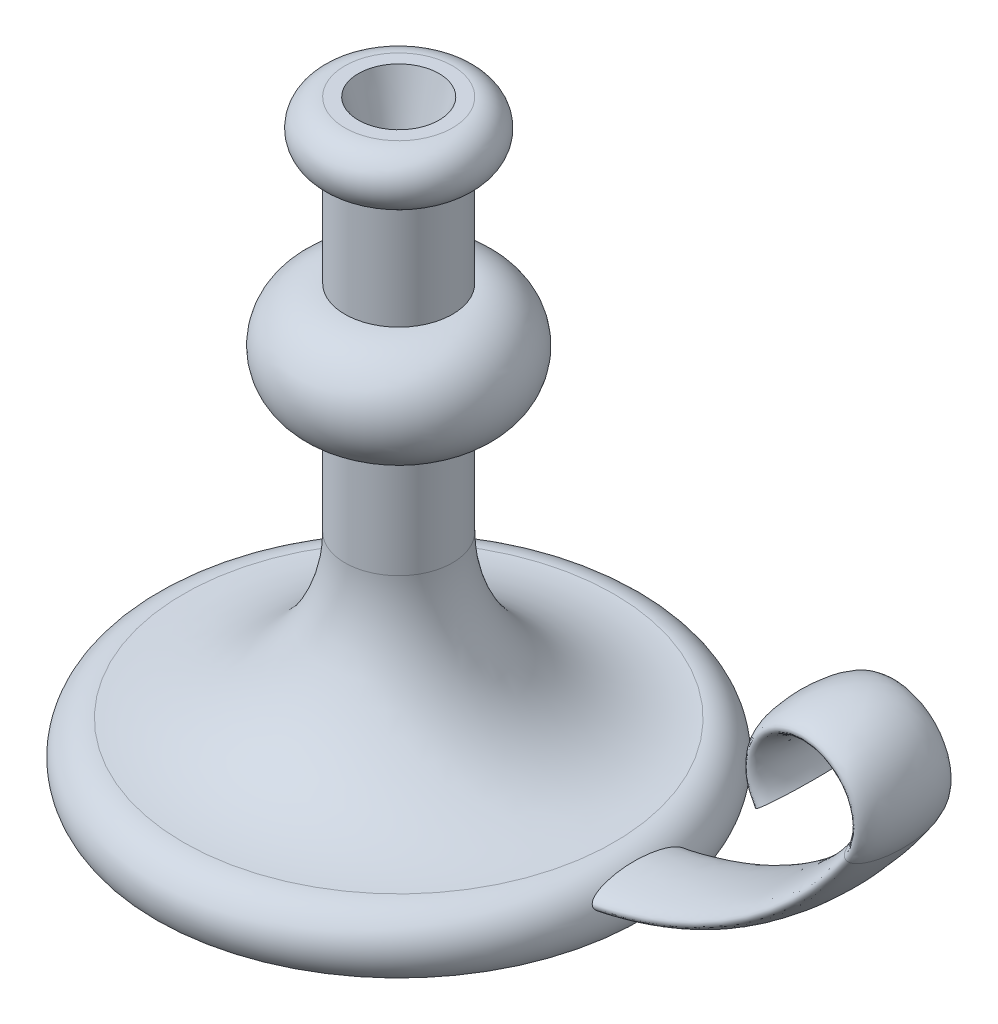
ISO-10303-21;
HEADER;
FILE_DESCRIPTION(('STEP AP214'),'2;1');
FILE_NAME('part.step','',(''),(''),'','','');
FILE_SCHEMA(('AUTOMOTIVE_DESIGN { 1 0 10303 214 1 1 1 1 }'));
ENDSEC;
DATA;
#1=APPLICATION_CONTEXT('core data for automotive mechanical design processes');
#2=APPLICATION_PROTOCOL_DEFINITION('international standard','automotive_design',2000,#1);
#3=PRODUCT_CONTEXT('',#1,'mechanical');
#4=PRODUCT('Part','Part','',(#3));
#5=PRODUCT_RELATED_PRODUCT_CATEGORY('part','',(#4));
#6=PRODUCT_DEFINITION_FORMATION('','',#4);
#7=PRODUCT_DEFINITION_CONTEXT('part definition',#1,'design');
#8=PRODUCT_DEFINITION('design','',#6,#7);
#9=PRODUCT_DEFINITION_SHAPE('','',#8);
#10=(LENGTH_UNIT() NAMED_UNIT(*) SI_UNIT(.MILLI.,.METRE.));
#11=(NAMED_UNIT(*) PLANE_ANGLE_UNIT() SI_UNIT($,.RADIAN.));
#12=(NAMED_UNIT(*) SI_UNIT($,.STERADIAN.) SOLID_ANGLE_UNIT());
#13=UNCERTAINTY_MEASURE_WITH_UNIT(LENGTH_MEASURE(1.E-05),#10,'distance_accuracy_value','');
#14=(GEOMETRIC_REPRESENTATION_CONTEXT(3) GLOBAL_UNCERTAINTY_ASSIGNED_CONTEXT((#13)) GLOBAL_UNIT_ASSIGNED_CONTEXT((#10,
#11,#12)) REPRESENTATION_CONTEXT('',''));
#15=CARTESIAN_POINT('',(0.,0.,0.));
#16=DIRECTION('',(0.,0.,1.));
#17=DIRECTION('',(1.,0.,0.));
#18=AXIS2_PLACEMENT_3D('',#15,#16,#17);
#19=CARTESIAN_POINT('',(90.,0.,0.));
#20=DIRECTION('',(0.,-1.,0.));
#21=DIRECTION('',(0.,0.,-1.));
#22=AXIS2_PLACEMENT_3D('',#19,#20,#21);
#23=PLANE('',#22);
#24=CARTESIAN_POINT('',(0.,0.,0.));
#25=DIRECTION('',(0.,-1.,0.));
#26=DIRECTION('',(0.,0.,-1.));
#27=AXIS2_PLACEMENT_3D('',#24,#25,#26);
#28=CIRCLE('',#27,90.);
#29=CARTESIAN_POINT('',(0.,0.,-90.));
#30=VERTEX_POINT('',#29);
#31=EDGE_CURVE('E97',#30,#30,#28,.T.);
#32=ORIENTED_EDGE('',*,*,#31,.T.);
#33=EDGE_LOOP('',(#32));
#34=FACE_BOUND('',#33,.T.);
#35=ADVANCED_FACE('F55',(#34),#23,.T.);
#36=CARTESIAN_POINT('',(0.,220.,0.));
#37=DIRECTION('',(0.,1.,0.));
#38=DIRECTION('',(0.,0.,1.));
#39=AXIS2_PLACEMENT_3D('',#36,#37,#38);
#40=PLANE('',#39);
#41=CARTESIAN_POINT('',(0.,220.,0.));
#42=DIRECTION('',(0.,1.,0.));
#43=DIRECTION('',(0.,0.,1.));
#44=AXIS2_PLACEMENT_3D('',#41,#42,#43);
#45=CIRCLE('',#44,15.);
#46=CARTESIAN_POINT('',(0.,220.,15.));
#47=VERTEX_POINT('',#46);
#48=EDGE_CURVE('E113',#47,#47,#45,.T.);
#49=ORIENTED_EDGE('',*,*,#48,.F.);
#50=EDGE_LOOP('',(#49));
#51=FACE_BOUND('',#50,.T.);
#52=CARTESIAN_POINT('',(0.,220.,0.));
#53=DIRECTION('',(0.,-1.,0.));
#54=DIRECTION('',(0.,0.,-1.));
#55=AXIS2_PLACEMENT_3D('',#52,#53,#54);
#56=CIRCLE('',#55,20.);
#57=CARTESIAN_POINT('',(0.,220.,-20.));
#58=VERTEX_POINT('',#57);
#59=EDGE_CURVE('E67',#58,#58,#56,.T.);
#60=ORIENTED_EDGE('',*,*,#59,.F.);
#61=EDGE_LOOP('',(#60));
#62=FACE_BOUND('',#61,.T.);
#63=ADVANCED_FACE('F121',(#51,#62),#40,.T.);
#64=CARTESIAN_POINT('',(0.,210.,0.));
#65=DIRECTION('',(0.,-1.,0.));
#66=DIRECTION('',(0.,0.,-1.));
#67=AXIS2_PLACEMENT_3D('',#64,#65,#66);
#68=TOROIDAL_SURFACE('',#67,20.,9.99999999999999);
#69=ORIENTED_EDGE('',*,*,#59,.T.);
#70=EDGE_LOOP('',(#69));
#71=FACE_BOUND('',#70,.T.);
#72=CARTESIAN_POINT('',(0.,200.,0.));
#73=DIRECTION('',(0.,-1.,0.));
#74=DIRECTION('',(0.,0.,-1.));
#75=AXIS2_PLACEMENT_3D('',#72,#73,#74);
#76=CIRCLE('',#75,20.);
#77=CARTESIAN_POINT('',(0.,200.,-20.));
#78=VERTEX_POINT('',#77);
#79=EDGE_CURVE('E73',#78,#78,#76,.T.);
#80=ORIENTED_EDGE('',*,*,#79,.F.);
#81=EDGE_LOOP('',(#80));
#82=FACE_BOUND('',#81,.T.);
#83=ADVANCED_FACE('F124',(#71,#82),#68,.T.);
#84=CARTESIAN_POINT('',(0.,0.,0.));
#85=DIRECTION('',(0.,-1.,0.));
#86=DIRECTION('',(0.,0.,-1.));
#87=AXIS2_PLACEMENT_3D('',#84,#85,#86);
#88=CYLINDRICAL_SURFACE('',#87,20.);
#89=ORIENTED_EDGE('',*,*,#79,.T.);
#90=EDGE_LOOP('',(#89));
#91=FACE_BOUND('',#90,.T.);
#92=CARTESIAN_POINT('',(0.,160.,0.));
#93=DIRECTION('',(0.,-1.,0.));
#94=DIRECTION('',(0.,0.,-1.));
#95=AXIS2_PLACEMENT_3D('',#92,#93,#94);
#96=CIRCLE('',#95,20.);
#97=CARTESIAN_POINT('',(0.,160.,-20.));
#98=VERTEX_POINT('',#97);
#99=EDGE_CURVE('E79',#98,#98,#96,.T.);
#100=ORIENTED_EDGE('',*,*,#99,.F.);
#101=EDGE_LOOP('',(#100));
#102=FACE_BOUND('',#101,.T.);
#103=ADVANCED_FACE('F129',(#91,#102),#88,.T.);
#104=CARTESIAN_POINT('',(0.,140.,0.));
#105=DIRECTION('',(0.,-1.,0.));
#106=DIRECTION('',(0.,0.,-1.));
#107=AXIS2_PLACEMENT_3D('',#104,#105,#106);
#108=TOROIDAL_SURFACE('',#107,20.,20.);
#109=ORIENTED_EDGE('',*,*,#99,.T.);
#110=EDGE_LOOP('',(#109));
#111=FACE_BOUND('',#110,.T.);
#112=CARTESIAN_POINT('',(0.,120.,0.));
#113=DIRECTION('',(0.,-1.,0.));
#114=DIRECTION('',(0.,0.,-1.));
#115=AXIS2_PLACEMENT_3D('',#112,#113,#114);
#116=CIRCLE('',#115,20.);
#117=CARTESIAN_POINT('',(0.,120.,-20.));
#118=VERTEX_POINT('',#117);
#119=EDGE_CURVE('E85',#118,#118,#116,.T.);
#120=ORIENTED_EDGE('',*,*,#119,.F.);
#121=EDGE_LOOP('',(#120));
#122=FACE_BOUND('',#121,.T.);
#123=ADVANCED_FACE('F135',(#111,#122),#108,.T.);
#124=CARTESIAN_POINT('',(0.,0.,0.));
#125=DIRECTION('',(0.,-1.,0.));
#126=DIRECTION('',(0.,0.,-1.));
#127=AXIS2_PLACEMENT_3D('',#124,#125,#126);
#128=CYLINDRICAL_SURFACE('',#127,20.);
#129=ORIENTED_EDGE('',*,*,#119,.T.);
#130=EDGE_LOOP('',(#129));
#131=FACE_BOUND('',#130,.T.);
#132=CARTESIAN_POINT('',(0.,80.,0.));
#133=DIRECTION('',(0.,-1.,0.));
#134=DIRECTION('',(0.,0.,-1.));
#135=AXIS2_PLACEMENT_3D('',#132,#133,#134);
#136=CIRCLE('',#135,20.);
#137=CARTESIAN_POINT('',(0.,80.,-20.));
#138=VERTEX_POINT('',#137);
#139=EDGE_CURVE('E89',#138,#138,#136,.T.);
#140=ORIENTED_EDGE('',*,*,#139,.F.);
#141=EDGE_LOOP('',(#140));
#142=FACE_BOUND('',#141,.T.);
#143=ADVANCED_FACE('F139',(#131,#142),#128,.T.);
#144=CARTESIAN_POINT('',(0.,80.,0.));
#145=DIRECTION('',(0.,-1.,0.));
#146=DIRECTION('',(0.,0.,-1.));
#147=AXIS2_PLACEMENT_3D('',#144,#145,#146);
#148=TOROIDAL_SURFACE('',#147,80.,60.);
#149=ORIENTED_EDGE('',*,*,#139,.T.);
#150=EDGE_LOOP('',(#149));
#151=FACE_BOUND('',#150,.T.);
#152=CARTESIAN_POINT('',(0.,20.,0.));
#153=DIRECTION('',(0.,-1.,0.));
#154=DIRECTION('',(0.,0.,-1.));
#155=AXIS2_PLACEMENT_3D('',#152,#153,#154);
#156=CIRCLE('',#155,80.);
#157=CARTESIAN_POINT('',(0.,20.,-80.));
#158=VERTEX_POINT('',#157);
#159=EDGE_CURVE('E93',#158,#158,#156,.T.);
#160=ORIENTED_EDGE('',*,*,#159,.F.);
#161=EDGE_LOOP('',(#160));
#162=FACE_BOUND('',#161,.T.);
#163=ADVANCED_FACE('F143',(#151,#162),#148,.F.);
#164=CARTESIAN_POINT('',(0.,7.50000000000001,0.));
#165=DIRECTION('',(0.,-1.,0.));
#166=DIRECTION('',(0.,0.,-1.));
#167=AXIS2_PLACEMENT_3D('',#164,#165,#166);
#168=TOROIDAL_SURFACE('',#167,80.,12.5);
#169=CARTESIAN_POINT('',(89.5597422043342,12.9414346567555,17.5));
#170=CARTESIAN_POINT('',(89.5807278946485,12.8988393157081,17.5000019534777));
#171=CARTESIAN_POINT('',(89.6018125795404,12.8563039357769,17.4977816975197));
#172=CARTESIAN_POINT('',(89.6440155813562,12.771693833937,17.489002543543));
#173=CARTESIAN_POINT('',(89.6651339056646,12.7296192360718,17.4824425050804));
#174=CARTESIAN_POINT('',(89.7283289297819,12.6045076597417,17.4565216692095));
#175=CARTESIAN_POINT('',(89.7702246464786,12.5226255894255,17.4309204730636));
#176=CARTESIAN_POINT('',(89.8644276523312,12.3407735771966,17.3563532007827));
#177=CARTESIAN_POINT('',(89.9162117483189,12.242484901666,17.3027527423027));
#178=CARTESIAN_POINT('',(90.0163878681401,12.0551458272008,17.178826321144));
#179=CARTESIAN_POINT('',(90.0647710548456,11.966119226993,17.1084587296403));
#180=CARTESIAN_POINT('',(90.1524531790239,11.806984522925,16.9652391551481));
#181=CARTESIAN_POINT('',(90.1921458014336,11.7358878994478,16.8936963434585));
#182=CARTESIAN_POINT('',(90.2690886261224,11.5996259068224,16.7438969488311));
#183=CARTESIAN_POINT('',(90.3063367280021,11.5344656201532,16.665634722265));
#184=CARTESIAN_POINT('',(90.3786756485819,11.4092540815105,16.5039763875564));
#185=CARTESIAN_POINT('',(90.4137624747614,11.349212210629,16.4205713158718));
#186=CARTESIAN_POINT('',(90.4819450166471,11.2336894025401,16.2499454917114));
#187=CARTESIAN_POINT('',(90.5150413047903,11.1782071523835,16.162725848809));
#188=CARTESIAN_POINT('',(90.5839705930102,11.0637251825689,15.9728919395736));
#189=CARTESIAN_POINT('',(90.6195406839563,11.0053156128849,15.8698282905887));
#190=CARTESIAN_POINT('',(90.6886668526269,10.8929143897208,15.6606649910658));
#191=CARTESIAN_POINT('',(90.7222226971282,10.8389232475745,15.5545649910506));
#192=CARTESIAN_POINT('',(90.787486486134,10.7348751403119,15.3401290691864));
#193=CARTESIAN_POINT('',(90.8191972688173,10.6848120890841,15.2317969483067));
#194=CARTESIAN_POINT('',(90.881005962979,10.5880683385414,15.0131968985224));
#195=CARTESIAN_POINT('',(90.9111039714557,10.5413874357516,14.9029290865686));
#196=CARTESIAN_POINT('',(90.979897363352,10.4355491517098,14.6427529331225));
#197=CARTESIAN_POINT('',(91.0180072010883,10.377593665576,14.492201207548));
#198=CARTESIAN_POINT('',(91.091887555317,10.2663462891691,14.188807072287));
#199=CARTESIAN_POINT('',(91.1276577411368,10.2130550577559,14.0359643425397));
#200=CARTESIAN_POINT('',(91.1971197458645,10.1105127689612,13.7282685712581));
#201=CARTESIAN_POINT('',(91.2308091946811,10.0612662985098,13.5734134718709));
#202=CARTESIAN_POINT('',(91.2962483962878,9.96642044574795,13.2621801041719));
#203=CARTESIAN_POINT('',(91.3279980241889,9.92082129819989,13.1058017385395));
#204=CARTESIAN_POINT('',(91.4205951755327,9.78887458660796,12.6346162266684));
#205=CARTESIAN_POINT('',(91.4787589060981,9.70742476979592,12.3179025042441));
#206=CARTESIAN_POINT('',(91.5890957852254,9.55493826130149,11.67921888986));
#207=CARTESIAN_POINT('',(91.641236506382,9.48395741425903,11.3572303186108));
#208=CARTESIAN_POINT('',(91.7397682682944,9.35136221163194,10.7107316640822));
#209=CARTESIAN_POINT('',(91.7861636672357,9.28974074823242,10.3862236929833));
#210=CARTESIAN_POINT('',(91.8736976604511,9.1746371831805,9.73512886653555));
#211=CARTESIAN_POINT('',(91.9148370779327,9.12115380666533,9.40854234516801));
#212=CARTESIAN_POINT('',(91.9930777751443,9.02031209920315,8.74630339912598));
#213=CARTESIAN_POINT('',(92.0300669877613,8.97311921137157,8.41061269264321));
#214=CARTESIAN_POINT('',(92.0991833927575,8.88559842477432,7.73783252743928));
#215=CARTESIAN_POINT('',(92.1313104056235,8.8452707794675,7.40074301754594));
#216=CARTESIAN_POINT('',(92.1909161961866,8.77092313439266,6.72537142355328));
#217=CARTESIAN_POINT('',(92.2183937480205,8.73690479789181,6.38708904887174));
#218=CARTESIAN_POINT('',(92.2688480816039,8.67476840304499,5.70964427774273));
#219=CARTESIAN_POINT('',(92.2918247141674,8.64665054027192,5.37048185250281));
#220=CARTESIAN_POINT('',(92.3540877228586,8.57076604630487,4.3536718124465));
#221=CARTESIAN_POINT('',(92.3868571977359,8.53128338370554,3.67498389641627));
#222=CARTESIAN_POINT('',(92.4356134743347,8.47274161832894,2.31614711504049));
#223=CARTESIAN_POINT('',(92.4515998737813,8.45368300509715,1.63599821506802));
#224=CARTESIAN_POINT('',(92.4661200478781,8.43637339284855,0.357955102331753));
#225=CARTESIAN_POINT('',(92.4665389208555,8.43587490179708,-0.23988885614382));
#226=CARTESIAN_POINT('',(92.4546362797528,8.45006241260831,-1.43536153859175));
#227=CARTESIAN_POINT('',(92.4423128974783,8.46475064105846,-2.0329902181485));
#228=CARTESIAN_POINT('',(92.4047541650815,8.5097668077993,-3.22745109478545));
#229=CARTESIAN_POINT('',(92.379514731688,8.54009969200438,-3.82428298010723));
#230=CARTESIAN_POINT('',(92.3157217367252,8.61743320229676,-5.01694606233253));
#231=CARTESIAN_POINT('',(92.2771508465328,8.66445552395919,-5.6127749375612));
#232=CARTESIAN_POINT('',(92.1861026743767,8.77678784246254,-6.80153886380923));
#233=CARTESIAN_POINT('',(92.1336290020919,8.84209309262497,-7.39447462535071));
#234=CARTESIAN_POINT('',(92.0437550848419,8.95574227206708,-8.28055229820489));
#235=CARTESIAN_POINT('',(92.0119455213755,8.99622894552009,-8.57528682166701));
#236=CARTESIAN_POINT('',(91.9444204496405,9.08291539794884,-9.16346094428856));
#237=CARTESIAN_POINT('',(91.9087051114866,9.12911492811454,-9.45690059926684));
#238=CARTESIAN_POINT('',(91.8331309715698,9.22782929334064,-10.042290603668));
#239=CARTESIAN_POINT('',(91.7932707518514,9.28034629056377,-10.3342404073465));
#240=CARTESIAN_POINT('',(91.709117916737,9.39245062081623,-10.9161852811049));
#241=CARTESIAN_POINT('',(91.6648247441273,9.45203884286021,-11.2061801005448));
#242=CARTESIAN_POINT('',(91.5713925727481,9.5793164533387,-11.7838191658164));
#243=CARTESIAN_POINT('',(91.5222504482682,9.64701107336915,-12.0714617643068));
#244=CARTESIAN_POINT('',(91.4186796874407,9.79172730085894,-12.6430805537627));
#245=CARTESIAN_POINT('',(91.3642572573636,9.86873798424082,-12.927060615035));
#246=CARTESIAN_POINT('',(91.2493765391176,10.0339529747879,-13.4904217181461));
#247=CARTESIAN_POINT('',(91.1889212109098,10.1221517983452,-13.7698049377443));
#248=CARTESIAN_POINT('',(91.0929373870875,10.2648274882361,-14.1839125047641));
#249=CARTESIAN_POINT('',(91.0600757486263,10.3140904181847,-14.3210581267381));
#250=CARTESIAN_POINT('',(90.9923938569387,10.416551102719,-14.5933763477644));
#251=CARTESIAN_POINT('',(90.9575737807137,10.4697485018481,-14.7285491237339));
#252=CARTESIAN_POINT('',(90.8810851838777,10.5878451344077,-15.0138774923673));
#253=CARTESIAN_POINT('',(90.8391147723958,10.653366620841,-15.1636969104744));
#254=CARTESIAN_POINT('',(90.7519625692613,10.7912189771814,-15.4593295355897));
#255=CARTESIAN_POINT('',(90.7067794219569,10.8635527258307,-15.6051410149847));
#256=CARTESIAN_POINT('',(90.6128939496975,11.0160439629676,-15.8905749729622));
#257=CARTESIAN_POINT('',(90.5642084544311,11.0961646105685,-16.0302224467125));
#258=CARTESIAN_POINT('',(90.4624897667353,11.2662530107873,-16.3016394850688));
#259=CARTESIAN_POINT('',(90.4094613083907,11.3562100760682,-16.4334173639365));
#260=CARTESIAN_POINT('',(90.3114276481005,11.5255085385049,-16.6553108138961));
#261=CARTESIAN_POINT('',(90.2675273757817,11.6022608890607,-16.7478644471361));
#262=CARTESIAN_POINT('',(90.1761749534326,11.7643292238687,-16.9236630994732));
#263=CARTESIAN_POINT('',(90.1287172073378,11.8496587754931,-17.0068929161981));
#264=CARTESIAN_POINT('',(90.0292807633426,12.0313291797368,-17.160728121925));
#265=CARTESIAN_POINT('',(89.9772518064337,12.1277974407353,-17.2311575389091));
#266=CARTESIAN_POINT('',(89.8965437818879,12.2800613987941,-17.3212876850735));
#267=CARTESIAN_POINT('',(89.8692277989253,12.3320164153136,-17.3487242132161));
#268=CARTESIAN_POINT('',(89.8138320311432,12.4382955168476,-17.3975211145679));
#269=CARTESIAN_POINT('',(89.7857527202503,12.4926181439797,-17.418885167671));
#270=CARTESIAN_POINT('',(89.7185869780337,12.6237048005597,-17.4611772226902));
#271=CARTESIAN_POINT('',(89.6792533408887,12.7013692224275,-17.4790502108363));
#272=CARTESIAN_POINT('',(89.6005512815565,12.8586256339483,-17.4997317533412));
#273=CARTESIAN_POINT('',(89.5611829132234,12.9382160139947,-17.5025524785485));
#274=CARTESIAN_POINT('',(89.4835317885697,13.0969633423242,-17.4927372657774));
#275=CARTESIAN_POINT('',(89.4452490812937,13.1761202708962,-17.4801006306501));
#276=CARTESIAN_POINT('',(89.3707047667356,13.3318071774561,-17.4406494077291));
#277=CARTESIAN_POINT('',(89.3344452993773,13.408334342353,-17.413820111618));
#278=CARTESIAN_POINT('',(89.2510611220236,13.5858554385681,-17.3357126521073));
#279=CARTESIAN_POINT('',(89.2050998650832,13.6849823777218,-17.2790047620842));
#280=CARTESIAN_POINT('',(89.1180744174557,13.8744276311817,-17.1491670423828));
#281=CARTESIAN_POINT('',(89.077030105826,13.9647099356684,-17.07597378213));
#282=CARTESIAN_POINT('',(89.0037033744713,14.1271434857569,-16.9270577307042));
#283=CARTESIAN_POINT('',(88.9709541551905,14.200194568073,-16.8525208708989));
#284=CARTESIAN_POINT('',(88.9084968426191,14.3401811690446,-16.6970292692114));
#285=CARTESIAN_POINT('',(88.8787841266135,14.4071259665767,-16.6160846261896));
#286=CARTESIAN_POINT('',(88.821781438855,14.535999563088,-16.4490709627682));
#287=CARTESIAN_POINT('',(88.7944998605828,14.5979109242409,-16.3629857823215));
#288=CARTESIAN_POINT('',(88.7420667437371,14.7171734064657,-16.1870697873636));
#289=CARTESIAN_POINT('',(88.7169159331094,14.7745229686598,-16.0972377082956));
#290=CARTESIAN_POINT('',(88.6682699235338,14.8855899090509,-15.9140699306469));
#291=CARTESIAN_POINT('',(88.6447869137158,14.9392804489422,-15.8207148279066));
#292=CARTESIAN_POINT('',(88.5993971939429,15.0431008843878,-15.631662696144));
#293=CARTESIAN_POINT('',(88.5774907604159,15.0932301555098,-15.5359652603532));
#294=CARTESIAN_POINT('',(88.5137514786222,15.2390285874182,-15.2458062448796));
#295=CARTESIAN_POINT('',(88.4739596847915,15.3299685477355,-15.0485147207857));
#296=CARTESIAN_POINT('',(88.3985337506617,15.5017775203621,-14.6487152633399));
#297=CARTESIAN_POINT('',(88.3629029634841,15.5826384140036,-14.4462032813486));
#298=CARTESIAN_POINT('',(88.2948356711214,15.7363066128667,-14.0365764701703));
#299=CARTESIAN_POINT('',(88.2624142295171,15.8090761199811,-13.8294450545364));
#300=CARTESIAN_POINT('',(88.2003835751384,15.9473648801952,-13.4126289871776));
#301=CARTESIAN_POINT('',(88.1707714189816,16.0128917338218,-13.2029472733599));
#302=CARTESIAN_POINT('',(88.113904936194,16.1377375745616,-12.7814949946319));
#303=CARTESIAN_POINT('',(88.086650040851,16.1970580597499,-12.5697249473646));
#304=CARTESIAN_POINT('',(88.0276172572032,16.32442356623,-12.0912931700798));
#305=CARTESIAN_POINT('',(87.9964138193047,16.3909381265489,-11.8241540502364));
#306=CARTESIAN_POINT('',(87.936771763662,16.5165936764715,-11.2878278414671));
#307=CARTESIAN_POINT('',(87.9083334164424,16.5757339447656,-11.0186405549296));
#308=CARTESIAN_POINT('',(87.8539266282974,16.6875098948952,-10.4785408424906));
#309=CARTESIAN_POINT('',(87.827959373049,16.7401424577991,-10.2076276543217));
#310=CARTESIAN_POINT('',(87.7783184309334,16.8395301522932,-9.66451168000086));
#311=CARTESIAN_POINT('',(87.7546448506398,16.8862850108113,-9.3923088345419));
#312=CARTESIAN_POINT('',(87.6869994555327,17.0182803050944,-8.57578965922079));
#313=CARTESIAN_POINT('',(87.6462388525849,17.0955854003683,-8.0299116722576));
#314=CARTESIAN_POINT('',(87.5728065515613,17.2320145687299,-6.93552385094338));
#315=CARTESIAN_POINT('',(87.5401330675684,17.2911426566324,-6.38701462498443));
#316=CARTESIAN_POINT('',(87.4828441952973,17.3930876120971,-5.2895588485129));
#317=CARTESIAN_POINT('',(87.4582074588683,17.435947742932,-4.74061740412959));
#318=CARTESIAN_POINT('',(87.4169410999174,17.5068884934699,-3.64146108219182));
#319=CARTESIAN_POINT('',(87.4003119088604,17.5349683167837,-3.09124613762291));
#320=CARTESIAN_POINT('',(87.375169948199,17.5771566462023,-1.98980868969755));
#321=CARTESIAN_POINT('',(87.3666614689744,17.5912577671531,-1.43858580772686));
#322=CARTESIAN_POINT('',(87.3578539704596,17.6058511840595,-0.335909067651535));
#323=CARTESIAN_POINT('',(87.3575547550007,17.6063438052041,0.215544784618917));
#324=CARTESIAN_POINT('',(87.3651677510507,17.5937352162514,1.31815822775566));
#325=CARTESIAN_POINT('',(87.3730787250642,17.5806360547998,1.86931785044398));
#326=CARTESIAN_POINT('',(87.3970372477741,17.540486829275,2.97097544676992));
#327=CARTESIAN_POINT('',(87.4130850653535,17.5134363041764,3.52147339793988));
#328=CARTESIAN_POINT('',(87.4531996813078,17.4446213827581,4.62112135666007));
#329=CARTESIAN_POINT('',(87.4772644593788,17.4028606933026,5.17027166873341));
#330=CARTESIAN_POINT('',(87.5333316774056,17.303370761274,6.26670053622696));
#331=CARTESIAN_POINT('',(87.5653334299477,17.2456429015525,6.8139792495853));
#332=CARTESIAN_POINT('',(87.6208220531226,17.1429049509095,7.65503321382918));
#333=CARTESIAN_POINT('',(87.6414679669254,17.1042333246751,7.94978028808067));
#334=CARTESIAN_POINT('',(87.685164959345,17.0212250701565,8.53829462761451));
#335=CARTESIAN_POINT('',(87.7082159678745,16.9768886069438,8.8320619211915));
#336=CARTESIAN_POINT('',(87.7568106691331,16.8820510369691,9.41827197236188));
#337=CARTESIAN_POINT('',(87.7823533405995,16.8315524537757,9.71071522164159));
#338=CARTESIAN_POINT('',(87.8360989952259,16.7237193681061,10.2940938312688));
#339=CARTESIAN_POINT('',(87.8643018909551,16.6663850902753,10.5850292408416));
#340=CARTESIAN_POINT('',(87.9147712499542,16.5622842610517,11.0784529887168));
#341=CARTESIAN_POINT('',(87.9362980252948,16.5174691899802,11.281429383528));
#342=CARTESIAN_POINT('',(87.9809118301298,16.4236835134764,11.6862455623025));
#343=CARTESIAN_POINT('',(88.0039988123348,16.3747130339816,11.8880853805141));
#344=CARTESIAN_POINT('',(88.0519198244937,16.2721215384772,12.2905621648797));
#345=CARTESIAN_POINT('',(88.0767553337318,16.2184965755442,12.4911979528368));
#346=CARTESIAN_POINT('',(88.1283787004662,16.1060707847352,12.8907612736795));
#347=CARTESIAN_POINT('',(88.1551664933017,16.0472701282676,13.0896888628979));
#348=CARTESIAN_POINT('',(88.2109999780498,15.9237718205589,13.4854201231371));
#349=CARTESIAN_POINT('',(88.2400459194853,15.8590735174978,13.6822235566971));
#350=CARTESIAN_POINT('',(88.3008027999427,15.7228691935866,14.073041987286));
#351=CARTESIAN_POINT('',(88.3325134779578,15.6513638393857,14.2670572552365));
#352=CARTESIAN_POINT('',(88.3991424541954,15.5003948115873,14.6511973591104));
#353=CARTESIAN_POINT('',(88.434057511581,15.420939171544,14.8413258930628));
#354=CARTESIAN_POINT('',(88.5079196083042,15.2523848762579,15.2164401400139));
#355=CARTESIAN_POINT('',(88.5468648114123,15.1632906117664,15.4014281468462));
#356=CARTESIAN_POINT('',(88.6092096238845,15.0206579718884,15.6733114229617));
#357=CARTESIAN_POINT('',(88.6306485895096,14.9716086740038,15.7630166800347));
#358=CARTESIAN_POINT('',(88.6750422753307,14.8701248615234,15.9401002079352));
#359=CARTESIAN_POINT('',(88.6979967332492,14.8176909327211,16.027478877758));
#360=CARTESIAN_POINT('',(88.7456840101795,14.7089478844285,16.1993887567117));
#361=CARTESIAN_POINT('',(88.7704179688266,14.6526362825902,16.2839180892529));
#362=CARTESIAN_POINT('',(88.8219484857475,14.5356422617913,16.4492391224742));
#363=CARTESIAN_POINT('',(88.8487445345044,14.4749609227752,16.5300317386021));
#364=CARTESIAN_POINT('',(88.8976102788184,14.3647434848956,16.6667168433042));
#365=CARTESIAN_POINT('',(88.9191374191607,14.3163230322087,16.7236955334937));
#366=CARTESIAN_POINT('',(88.9637080676466,14.2164452982166,16.8342912802666));
#367=CARTESIAN_POINT('',(88.986751947851,14.164987272107,16.8879075056809));
#368=CARTESIAN_POINT('',(89.0583610181497,14.0058008216805,17.0423310846548));
#369=CARTESIAN_POINT('',(89.10952892341,13.8929758416965,17.1370796109717));
#370=CARTESIAN_POINT('',(89.199900155457,13.6963386208984,17.2707956184659));
#371=CARTESIAN_POINT('',(89.2367505169317,13.6167644879692,17.3175503480625));
#372=CARTESIAN_POINT('',(89.3136877653846,13.4522974166021,17.3968468737182));
#373=CARTESIAN_POINT('',(89.3537667767862,13.3674175273974,17.4294220837178));
#374=CARTESIAN_POINT('',(89.421709121789,13.2251848973549,17.4685967336682));
#375=CARTESIAN_POINT('',(89.4488093840977,13.1688551716182,17.4803204652975));
#376=CARTESIAN_POINT('',(89.5037947740348,13.0554594934974,17.4960211898048));
#377=CARTESIAN_POINT('',(89.5316799818999,12.9983934661743,17.499997387795));
#378=CARTESIAN_POINT('',(89.5597422043342,12.9414346567555,17.5));
#379=B_SPLINE_CURVE_WITH_KNOTS('',3,(#169,#170,#171,#172,#173,#174,#175,#176,#177,#178,#179,
#180,#181,#182,#183,#184,#185,#186,#187,#188,#189,#190,#191,#192,#193,#194,#195,#196,#197,#198,
#199,#200,#201,#202,#203,#204,#205,#206,#207,#208,#209,#210,#211,#212,#213,#214,#215,#216,#217,
#218,#219,#220,#221,#222,#223,#224,#225,#226,#227,#228,#229,#230,#231,#232,#233,#234,#235,#236,
#237,#238,#239,#240,#241,#242,#243,#244,#245,#246,#247,#248,#249,#250,#251,#252,#253,#254,#255,
#256,#257,#258,#259,#260,#261,#262,#263,#264,#265,#266,#267,#268,#269,#270,#271,#272,#273,#274,
#275,#276,#277,#278,#279,#280,#281,#282,#283,#284,#285,#286,#287,#288,#289,#290,#291,#292,#293,
#294,#295,#296,#297,#298,#299,#300,#301,#302,#303,#304,#305,#306,#307,#308,#309,#310,#311,#312,
#313,#314,#315,#316,#317,#318,#319,#320,#321,#322,#323,#324,#325,#326,#327,#328,#329,#330,#331,
#332,#333,#334,#335,#336,#337,#338,#339,#340,#341,#342,#343,#344,#345,#346,#347,#348,#349,#350,
#351,#352,#353,#354,#355,#356,#357,#358,#359,#360,#361,#362,#363,#364,#365,#366,#367,#368,#369,
#370,#371,#372,#373,#374,#375,#376,#377,#378),.UNSPECIFIED.,.T.,.F.,(4,2,2,2,2,2,2,2,2,2,2,2,2,
2,2,2,2,2,2,2,2,2,2,2,2,2,2,2,2,2,2,2,2,2,2,2,2,2,2,2,2,2,2,2,2,2,2,2,2,2,2,2,2,2,2,2,2,2,2,2,2,
2,2,2,2,2,2,2,2,2,2,2,2,2,2,2,2,2,2,2,2,2,2,2,2,2,2,2,2,2,2,2,2,2,2,2,2,2,2,2,2,2,2,2,4),(0.,
0.142381357158817,0.284800145338807,0.5697783697104,0.937790990160529,1.30672699797604,
1.63143353328554,1.95641550824172,2.28198085179477,2.60745211744532,2.9783575882575,
3.34930592253146,3.71966767593579,4.09000712931069,4.58717127025783,5.08440552627611,
5.58219609730429,6.08001868322215,7.0761274049116,8.0773711140143,9.07785060328492,
10.0781732018631,11.1010679437464,12.1240004418371,13.1472022244409,14.1704379160045,
16.2117115539476,18.2530341182275,20.046245769242,21.8397203676841,23.6337623045226,
25.4301450150663,27.2260617741972,28.1235892294174,29.0210776087,29.9188740333843,
30.8167834514317,31.7152755049916,32.6127240115713,33.5097343418998,33.9578247270809,
34.4058746792323,34.9121604747934,35.4186611861167,35.9228725276492,36.426541383562,
36.8100240505596,37.1941231504199,37.5831580539591,37.777258645004,37.9712413599166,
38.2366258142315,38.5017956533798,38.7669774525068,39.0324346081146,39.3996555983546,
39.7683144393118,40.0959866375236,40.4231523204123,40.7514069982207,41.0797733710071,
41.4103344436372,41.7409533344644,42.403033956626,43.0656444835719,43.7312306850936,
44.3961116446137,45.0608317450483,45.8918608553056,46.7229711882475,47.5544783139729,
48.386024056412,50.044042604114,51.701694676297,53.3549069476139,55.0082082878399,
56.6623826267277,58.3165174374116,59.9704029618853,61.6243431428128,63.2778668395554,
64.9312473761583,65.8251617717328,66.7190501248621,67.6125736254146,68.5060677696778,
69.1329546330612,69.7598225042244,70.3872272415046,71.0146112082172,71.6420645989475,
72.2694566030622,72.8962209263416,73.5227009279484,73.8360175198366,74.1492800292277,
74.4627449766579,74.7761327179482,75.009418944318,75.242762611333,75.7080186392205,
76.0052441465101,76.301765401323,76.4921392885513,76.6825327068869),.UNSPECIFIED.);
#380=CARTESIAN_POINT('',(89.5597422043342,12.9414346567555,17.5));
#381=VERTEX_POINT('',#380);
#382=EDGE_CURVE('E12',#381,#381,#379,.T.);
#383=ORIENTED_EDGE('',*,*,#382,.F.);
#384=EDGE_LOOP('',(#383));
#385=FACE_BOUND('',#384,.T.);
#386=ORIENTED_EDGE('',*,*,#159,.T.);
#387=EDGE_LOOP('',(#386));
#388=FACE_BOUND('',#387,.T.);
#389=ORIENTED_EDGE('',*,*,#31,.F.);
#390=EDGE_LOOP('',(#389));
#391=FACE_BOUND('',#390,.T.);
#392=ADVANCED_FACE('F146',(#385,#388,#391),#168,.T.);
#393=CARTESIAN_POINT('',(150.634185358261,75.,0.));
#394=DIRECTION('',(0.566666666666667,-0.823947139620552,0.));
#395=DIRECTION('',(0.,0.,-1.));
#396=AXIS2_PLACEMENT_3D('',#393,#394,#395);
#397=PLANE('',#396);
#398=CARTESIAN_POINT('',(150.634185358261,75.,0.));
#399=DIRECTION('',(0.566666666666667,-0.823947139620552,0.));
#400=DIRECTION('',(0.,0.,1.));
#401=AXIS2_PLACEMENT_3D('',#398,#399,#400);
#402=ELLIPSE('',#401,17.5,5.);
#403=CARTESIAN_POINT('',(150.634185358261,75.,17.5));
#404=VERTEX_POINT('',#403);
#405=EDGE_CURVE('E101',#404,#404,#402,.T.);
#406=ORIENTED_EDGE('',*,*,#405,.T.);
#407=EDGE_LOOP('',(#406));
#408=FACE_BOUND('',#407,.T.);
#409=ADVANCED_FACE('F151',(#408),#397,.T.);
#410=CARTESIAN_POINT('',(60.,10.,17.5));
#411=CARTESIAN_POINT('',(110.410191303973,10.,17.5));
#412=CARTESIAN_POINT('',(155.026295870831,33.4646670673665,17.5));
#413=CARTESIAN_POINT('',(183.592070943083,75.,17.5));
#414=CARTESIAN_POINT('',(60.,0.,17.5));
#415=CARTESIAN_POINT('',(113.770870724238,0.,17.5));
#416=CARTESIAN_POINT('',(161.36138226222,25.0289782051909,17.5));
#417=CARTESIAN_POINT('',(191.831542339288,69.3333333333333,17.5));
#418=CARTESIAN_POINT('',(60.,0.,-17.5));
#419=CARTESIAN_POINT('',(113.770870724238,0.,-17.5));
#420=CARTESIAN_POINT('',(161.36138226222,25.0289782051909,-17.5));
#421=CARTESIAN_POINT('',(191.831542339288,69.3333333333333,-17.5));
#422=CARTESIAN_POINT('',(60.,10.,-17.5));
#423=CARTESIAN_POINT('',(110.410191303973,10.,-17.5));
#424=CARTESIAN_POINT('',(155.026295870831,33.4646670673665,-17.5));
#425=CARTESIAN_POINT('',(183.592070943083,75.,-17.5));
#426=CARTESIAN_POINT('',(60.,20.,-17.5));
#427=CARTESIAN_POINT('',(107.049511883708,20.,-17.5));
#428=CARTESIAN_POINT('',(148.691209479443,41.9003559295421,-17.5));
#429=CARTESIAN_POINT('',(175.352599546877,80.6666666666666,-17.5));
#430=CARTESIAN_POINT('',(60.,20.,17.5));
#431=CARTESIAN_POINT('',(107.049511883708,20.,17.5));
#432=CARTESIAN_POINT('',(148.691209479443,41.9003559295421,17.5));
#433=CARTESIAN_POINT('',(175.352599546877,80.6666666666666,17.5));
#434=CARTESIAN_POINT('',(60.,10.,17.5));
#435=CARTESIAN_POINT('',(110.410191303973,10.,17.5));
#436=CARTESIAN_POINT('',(155.026295870831,33.4646670673665,17.5));
#437=CARTESIAN_POINT('',(183.592070943083,75.,17.5));
#438=(BOUNDED_SURFACE() B_SPLINE_SURFACE(3,3,((#410,#411,#412,#413),(#414,#415,#416,#417),(#418,
#419,#420,#421),(#422,#423,#424,#425),(#426,#427,#428,#429),(#430,#431,#432,#433),(#434,#435,
#436,#437)),.UNSPECIFIED.,.T.,.F.,.F.) B_SPLINE_SURFACE_WITH_KNOTS((4,3,4),(4,4),(0.,0.5,1.),
(0.,1.),.UNSPECIFIED.) GEOMETRIC_REPRESENTATION_ITEM() RATIONAL_B_SPLINE_SURFACE(((1.,
0.923374135437856,0.923374135437856,1.),(0.333333333333333,0.307791378479285,0.307791378479285,
0.333333333333333),(0.333333333333333,0.307791378479285,0.307791378479285,0.333333333333333),
(1.,0.923374135437856,0.923374135437856,1.),(0.333333333333333,0.307791378479285,
0.307791378479285,0.333333333333333),(0.333333333333333,0.307791378479285,0.307791378479285,
0.333333333333333),(1.,0.923374135437856,0.923374135437856,1.))) REPRESENTATION_ITEM('') SURFACE());
#439=CARTESIAN_POINT('',(183.592070943083,75.,0.));
#440=DIRECTION('',(0.566666666666667,0.823947139620552,0.));
#441=DIRECTION('',(0.,0.,1.));
#442=AXIS2_PLACEMENT_3D('',#439,#440,#441);
#443=ELLIPSE('',#442,17.5,5.);
#444=CARTESIAN_POINT('',(183.592070943083,75.,17.5));
#445=VERTEX_POINT('',#444);
#446=EDGE_CURVE('E105',#445,#445,#443,.T.);
#447=ORIENTED_EDGE('',*,*,#382,.T.);
#448=EDGE_LOOP('',(#447));
#449=FACE_BOUND('',#448,.T.);
#450=ORIENTED_EDGE('',*,*,#446,.F.);
#451=EDGE_LOOP('',(#450));
#452=FACE_BOUND('',#451,.T.);
#453=ADVANCED_FACE('F156',(#449,#452),#438,.T.);
#454=CARTESIAN_POINT('',(183.592070943083,75.,17.5));
#455=CARTESIAN_POINT('',(193.981461744242,90.1064273523801,17.5));
#456=CARTESIAN_POINT('',(185.447347211541,106.333333333333,17.5));
#457=CARTESIAN_POINT('',(167.113128150672,106.333333333333,17.5));
#458=CARTESIAN_POINT('',(148.778909089802,106.333333333333,17.5));
#459=CARTESIAN_POINT('',(140.244794557101,90.1064273523801,17.5));
#460=CARTESIAN_POINT('',(150.634185358261,75.,17.5));
#461=CARTESIAN_POINT('',(191.831542339288,69.3333333333333,17.5));
#462=CARTESIAN_POINT('',(207.415628541027,91.9929743619034,17.5));
#463=CARTESIAN_POINT('',(194.614456741976,116.333333333333,17.5));
#464=CARTESIAN_POINT('',(167.113128150672,116.333333333333,17.5));
#465=CARTESIAN_POINT('',(139.611799559367,116.333333333333,17.5));
#466=CARTESIAN_POINT('',(126.810627760316,91.9929743619034,17.5));
#467=CARTESIAN_POINT('',(142.394713962055,69.3333333333333,17.5));
#468=CARTESIAN_POINT('',(191.831542339288,69.3333333333333,-17.5));
#469=CARTESIAN_POINT('',(207.415628541027,91.9929743619034,-17.5));
#470=CARTESIAN_POINT('',(194.614456741976,116.333333333333,-17.5));
#471=CARTESIAN_POINT('',(167.113128150672,116.333333333333,-17.5));
#472=CARTESIAN_POINT('',(139.611799559367,116.333333333333,-17.5));
#473=CARTESIAN_POINT('',(126.810627760316,91.9929743619034,-17.5));
#474=CARTESIAN_POINT('',(142.394713962055,69.3333333333333,-17.5));
#475=CARTESIAN_POINT('',(183.592070943083,75.,-17.5));
#476=CARTESIAN_POINT('',(193.981461744242,90.1064273523801,-17.5));
#477=CARTESIAN_POINT('',(185.447347211541,106.333333333333,-17.5));
#478=CARTESIAN_POINT('',(167.113128150672,106.333333333333,-17.5));
#479=CARTESIAN_POINT('',(148.778909089802,106.333333333333,-17.5));
#480=CARTESIAN_POINT('',(140.244794557101,90.1064273523801,-17.5));
#481=CARTESIAN_POINT('',(150.634185358261,75.,-17.5));
#482=CARTESIAN_POINT('',(175.352599546877,80.6666666666667,-17.5));
#483=CARTESIAN_POINT('',(180.547294947457,88.2198803428567,-17.5));
#484=CARTESIAN_POINT('',(176.280237681106,96.3333333333334,-17.5));
#485=CARTESIAN_POINT('',(167.113128150672,96.3333333333333,-17.5));
#486=CARTESIAN_POINT('',(157.946018620237,96.3333333333333,-17.5));
#487=CARTESIAN_POINT('',(153.678961353886,88.2198803428566,-17.5));
#488=CARTESIAN_POINT('',(158.873656754466,80.6666666666666,-17.5));
#489=CARTESIAN_POINT('',(175.352599546877,80.6666666666667,17.5));
#490=CARTESIAN_POINT('',(180.547294947457,88.2198803428567,17.5));
#491=CARTESIAN_POINT('',(176.280237681106,96.3333333333334,17.5));
#492=CARTESIAN_POINT('',(167.113128150672,96.3333333333333,17.5));
#493=CARTESIAN_POINT('',(157.946018620237,96.3333333333333,17.5));
#494=CARTESIAN_POINT('',(153.678961353886,88.2198803428566,17.5));
#495=CARTESIAN_POINT('',(158.873656754466,80.6666666666666,17.5));
#496=CARTESIAN_POINT('',(183.592070943083,75.,17.5));
#497=CARTESIAN_POINT('',(193.981461744242,90.1064273523801,17.5));
#498=CARTESIAN_POINT('',(185.447347211541,106.333333333333,17.5));
#499=CARTESIAN_POINT('',(167.113128150672,106.333333333333,17.5));
#500=CARTESIAN_POINT('',(148.778909089802,106.333333333333,17.5));
#501=CARTESIAN_POINT('',(140.244794557101,90.1064273523801,17.5));
#502=CARTESIAN_POINT('',(150.634185358261,75.,17.5));
#503=(BOUNDED_SURFACE() B_SPLINE_SURFACE(3,3,((#454,#455,#456,#457,#458,#459,#460),(#461,#462,
#463,#464,#465,#466,#467),(#468,#469,#470,#471,#472,#473,#474),(#475,#476,#477,#478,#479,#480,
#481),(#482,#483,#484,#485,#486,#487,#488),(#489,#490,#491,#492,#493,#494,#495),(#496,#497,#498,
#499,#500,#501,#502)),.UNSPECIFIED.,.T.,.F.,.F.) B_SPLINE_SURFACE_WITH_KNOTS((4,3,4),(4,3,4),
(0.,0.5,1.),(0.,0.5,1.),
.UNSPECIFIED.) GEOMETRIC_REPRESENTATION_ITEM() RATIONAL_B_SPLINE_SURFACE(((1.,0.643649778750421,
0.643649778750421,1.,0.643649778750421,0.643649778750421,1.),(0.333333333333333,
0.21454992625014,0.21454992625014,0.333333333333333,0.21454992625014,0.21454992625014,
0.333333333333333),(0.333333333333333,0.21454992625014,0.21454992625014,0.333333333333333,
0.21454992625014,0.21454992625014,0.333333333333333),(1.,0.643649778750421,0.643649778750421,1.,
0.643649778750421,0.643649778750421,1.),(0.333333333333333,0.21454992625014,0.21454992625014,
0.333333333333333,0.21454992625014,0.21454992625014,0.333333333333333),(0.333333333333333,
0.21454992625014,0.21454992625014,0.333333333333333,0.21454992625014,0.21454992625014,
0.333333333333333),(1.,0.643649778750421,0.643649778750421,1.,0.643649778750421,
0.643649778750421,1.))) REPRESENTATION_ITEM('') SURFACE());
#504=ORIENTED_EDGE('',*,*,#405,.F.);
#505=EDGE_LOOP('',(#504));
#506=FACE_BOUND('',#505,.T.);
#507=ORIENTED_EDGE('',*,*,#446,.T.);
#508=EDGE_LOOP('',(#507));
#509=FACE_BOUND('',#508,.T.);
#510=ADVANCED_FACE('F153',(#506,#509),#503,.T.);
#511=CARTESIAN_POINT('',(0.,220.,0.));
#512=DIRECTION('',(0.,1.,0.));
#513=DIRECTION('',(0.,0.,1.));
#514=AXIS2_PLACEMENT_3D('',#511,#512,#513);
#515=CONICAL_SURFACE('',#514,15.,0.26179938779915);
#516=CARTESIAN_POINT('',(0.,195.,0.));
#517=DIRECTION('',(0.,1.,0.));
#518=DIRECTION('',(0.,0.,1.));
#519=AXIS2_PLACEMENT_3D('',#516,#517,#518);
#520=CIRCLE('',#519,8.30127018922192);
#521=CARTESIAN_POINT('',(0.,195.,8.30127018922192));
#522=VERTEX_POINT('',#521);
#523=EDGE_CURVE('E109',#522,#522,#520,.T.);
#524=ORIENTED_EDGE('',*,*,#523,.F.);
#525=EDGE_LOOP('',(#524));
#526=FACE_BOUND('',#525,.T.);
#527=ORIENTED_EDGE('',*,*,#48,.T.);
#528=EDGE_LOOP('',(#527));
#529=FACE_BOUND('',#528,.T.);
#530=ADVANCED_FACE('F119',(#526,#529),#515,.F.);
#531=CARTESIAN_POINT('',(0.,195.,0.));
#532=DIRECTION('',(0.,1.,0.));
#533=DIRECTION('',(0.,0.,1.));
#534=AXIS2_PLACEMENT_3D('',#531,#532,#533);
#535=PLANE('',#534);
#536=ORIENTED_EDGE('',*,*,#523,.T.);
#537=EDGE_LOOP('',(#536));
#538=FACE_BOUND('',#537,.T.);
#539=ADVANCED_FACE('F179',(#538),#535,.T.);
#540=CLOSED_SHELL('',(#35,#63,#83,#103,#123,#143,#163,#392,#409,#453,#510,#530,#539));
#541=MANIFOLD_SOLID_BREP('B2',#540);
#542=ADVANCED_BREP_SHAPE_REPRESENTATION('',(#18,#541),#14);
#543=SHAPE_DEFINITION_REPRESENTATION(#9,#542);
ENDSEC;
END-ISO-10303-21;
